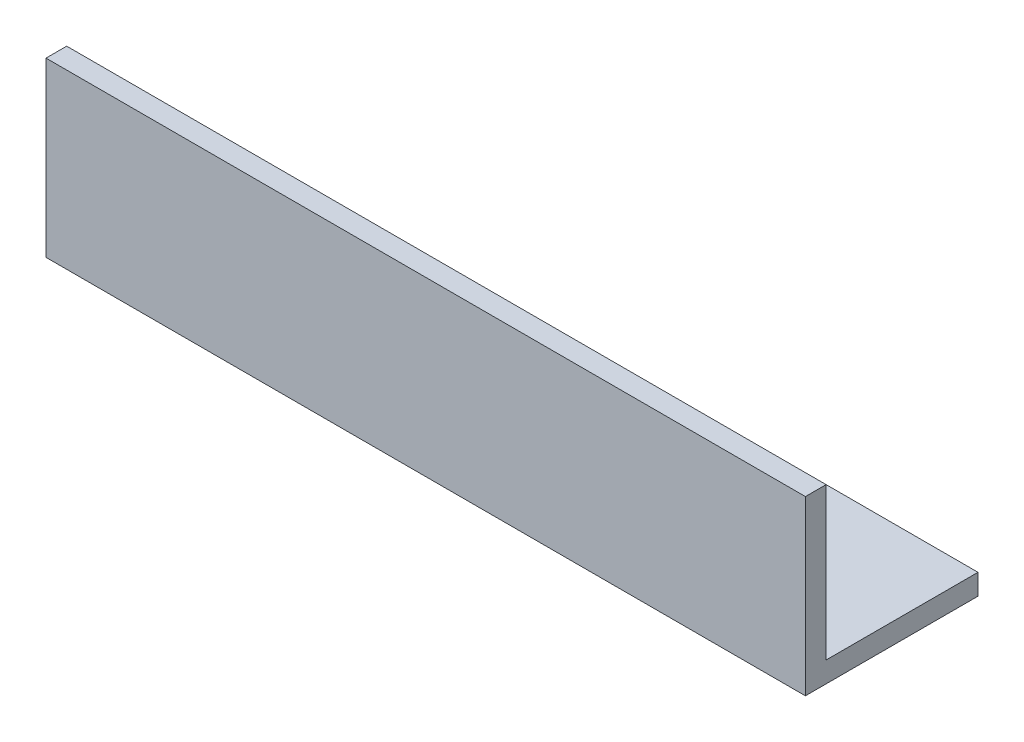
ISO-10303-21;
HEADER;
FILE_DESCRIPTION(('STEP AP214'),'2;1');
FILE_NAME('part.step','',(''),(''),'','','');
FILE_SCHEMA(('AUTOMOTIVE_DESIGN { 1 0 10303 214 1 1 1 1 }'));
ENDSEC;
DATA;
#1=APPLICATION_CONTEXT('core data for automotive mechanical design processes');
#2=APPLICATION_PROTOCOL_DEFINITION('international standard','automotive_design',2000,#1);
#3=PRODUCT_CONTEXT('',#1,'mechanical');
#4=PRODUCT('Part','Part','',(#3));
#5=PRODUCT_RELATED_PRODUCT_CATEGORY('part','',(#4));
#6=PRODUCT_DEFINITION_FORMATION('','',#4);
#7=PRODUCT_DEFINITION_CONTEXT('part definition',#1,'design');
#8=PRODUCT_DEFINITION('design','',#6,#7);
#9=PRODUCT_DEFINITION_SHAPE('','',#8);
#10=(LENGTH_UNIT() NAMED_UNIT(*) SI_UNIT(.MILLI.,.METRE.));
#11=(NAMED_UNIT(*) PLANE_ANGLE_UNIT() SI_UNIT($,.RADIAN.));
#12=(NAMED_UNIT(*) SI_UNIT($,.STERADIAN.) SOLID_ANGLE_UNIT());
#13=UNCERTAINTY_MEASURE_WITH_UNIT(LENGTH_MEASURE(1.E-05),#10,'distance_accuracy_value','');
#14=(GEOMETRIC_REPRESENTATION_CONTEXT(3) GLOBAL_UNCERTAINTY_ASSIGNED_CONTEXT((#13)) GLOBAL_UNIT_ASSIGNED_CONTEXT((#10,
#11,#12)) REPRESENTATION_CONTEXT('',''));
#15=CARTESIAN_POINT('',(0.,0.,0.));
#16=DIRECTION('',(0.,0.,1.));
#17=DIRECTION('',(1.,0.,0.));
#18=AXIS2_PLACEMENT_3D('',#15,#16,#17);
#19=CARTESIAN_POINT('',(110.,25.,-3.));
#20=DIRECTION('',(0.,-1.,0.));
#21=DIRECTION('',(0.,0.,-1.));
#22=AXIS2_PLACEMENT_3D('',#19,#20,#21);
#23=PLANE('',#22);
#24=DIRECTION('',(0.,0.,1.));
#25=VECTOR('',#24,1.);
#26=CARTESIAN_POINT('',(0.,25.,-3.));
#27=LINE('',#26,#25);
#28=CARTESIAN_POINT('',(0.,25.,-3.));
#29=VERTEX_POINT('',#28);
#30=CARTESIAN_POINT('',(0.,25.,0.));
#31=VERTEX_POINT('',#30);
#32=EDGE_CURVE('E118',#29,#31,#27,.T.);
#33=ORIENTED_EDGE('',*,*,#32,.T.);
#34=DIRECTION('',(-1.,0.,0.));
#35=VECTOR('',#34,1.);
#36=CARTESIAN_POINT('',(110.,25.,0.));
#37=LINE('',#36,#35);
#38=CARTESIAN_POINT('',(110.,25.,0.));
#39=VERTEX_POINT('',#38);
#40=EDGE_CURVE('E11',#39,#31,#37,.T.);
#41=ORIENTED_EDGE('',*,*,#40,.F.);
#42=DIRECTION('',(0.,0.,1.));
#43=VECTOR('',#42,1.);
#44=CARTESIAN_POINT('',(110.,25.,-3.));
#45=LINE('',#44,#43);
#46=CARTESIAN_POINT('',(110.,25.,-3.));
#47=VERTEX_POINT('',#46);
#48=EDGE_CURVE('E128',#47,#39,#45,.T.);
#49=ORIENTED_EDGE('',*,*,#48,.F.);
#50=DIRECTION('',(-1.,0.,0.));
#51=VECTOR('',#50,1.);
#52=CARTESIAN_POINT('',(110.,25.,-3.));
#53=LINE('',#52,#51);
#54=EDGE_CURVE('E114',#47,#29,#53,.T.);
#55=ORIENTED_EDGE('',*,*,#54,.T.);
#56=EDGE_LOOP('',(#33,#41,#49,#55));
#57=FACE_BOUND('',#56,.T.);
#58=ADVANCED_FACE('F34',(#57),#23,.F.);
#59=CARTESIAN_POINT('',(110.,25.,0.));
#60=DIRECTION('',(0.,0.,-1.));
#61=DIRECTION('',(0.,1.,0.));
#62=AXIS2_PLACEMENT_3D('',#59,#60,#61);
#63=PLANE('',#62);
#64=DIRECTION('',(0.,-1.,0.));
#65=VECTOR('',#64,1.);
#66=CARTESIAN_POINT('',(0.,25.,0.));
#67=LINE('',#66,#65);
#68=CARTESIAN_POINT('',(0.,0.,0.));
#69=VERTEX_POINT('',#68);
#70=EDGE_CURVE('E121',#31,#69,#67,.T.);
#71=ORIENTED_EDGE('',*,*,#70,.T.);
#72=DIRECTION('',(-1.,0.,0.));
#73=VECTOR('',#72,1.);
#74=CARTESIAN_POINT('',(110.,0.,0.));
#75=LINE('',#74,#73);
#76=CARTESIAN_POINT('',(110.,0.,0.));
#77=VERTEX_POINT('',#76);
#78=EDGE_CURVE('E42',#77,#69,#75,.T.);
#79=ORIENTED_EDGE('',*,*,#78,.F.);
#80=DIRECTION('',(0.,-1.,0.));
#81=VECTOR('',#80,1.);
#82=CARTESIAN_POINT('',(110.,25.,0.));
#83=LINE('',#82,#81);
#84=EDGE_CURVE('E87',#39,#77,#83,.T.);
#85=ORIENTED_EDGE('',*,*,#84,.F.);
#86=ORIENTED_EDGE('',*,*,#40,.T.);
#87=EDGE_LOOP('',(#71,#79,#85,#86));
#88=FACE_BOUND('',#87,.T.);
#89=ADVANCED_FACE('F152',(#88),#63,.F.);
#90=CARTESIAN_POINT('',(110.,0.,0.));
#91=DIRECTION('',(0.,1.,0.));
#92=DIRECTION('',(0.,0.,1.));
#93=AXIS2_PLACEMENT_3D('',#90,#91,#92);
#94=PLANE('',#93);
#95=DIRECTION('',(0.,0.,-1.));
#96=VECTOR('',#95,1.);
#97=CARTESIAN_POINT('',(0.,0.,0.));
#98=LINE('',#97,#96);
#99=CARTESIAN_POINT('',(0.,0.,-25.));
#100=VERTEX_POINT('',#99);
#101=EDGE_CURVE('E123',#69,#100,#98,.T.);
#102=ORIENTED_EDGE('',*,*,#101,.T.);
#103=DIRECTION('',(-1.,0.,0.));
#104=VECTOR('',#103,1.);
#105=CARTESIAN_POINT('',(110.,0.,-25.));
#106=LINE('',#105,#104);
#107=CARTESIAN_POINT('',(110.,0.,-25.));
#108=VERTEX_POINT('',#107);
#109=EDGE_CURVE('E109',#108,#100,#106,.T.);
#110=ORIENTED_EDGE('',*,*,#109,.F.);
#111=DIRECTION('',(0.,0.,-1.));
#112=VECTOR('',#111,1.);
#113=CARTESIAN_POINT('',(110.,0.,0.));
#114=LINE('',#113,#112);
#115=EDGE_CURVE('E100',#77,#108,#114,.T.);
#116=ORIENTED_EDGE('',*,*,#115,.F.);
#117=ORIENTED_EDGE('',*,*,#78,.T.);
#118=EDGE_LOOP('',(#102,#110,#116,#117));
#119=FACE_BOUND('',#118,.T.);
#120=ADVANCED_FACE('F134',(#119),#94,.F.);
#121=CARTESIAN_POINT('',(110.,0.,-25.));
#122=DIRECTION('',(0.,0.,1.));
#123=DIRECTION('',(1.,0.,0.));
#124=AXIS2_PLACEMENT_3D('',#121,#122,#123);
#125=PLANE('',#124);
#126=DIRECTION('',(0.,1.,0.));
#127=VECTOR('',#126,1.);
#128=CARTESIAN_POINT('',(0.,0.,-25.));
#129=LINE('',#128,#127);
#130=CARTESIAN_POINT('',(0.,3.,-25.));
#131=VERTEX_POINT('',#130);
#132=EDGE_CURVE('E108',#100,#131,#129,.T.);
#133=ORIENTED_EDGE('',*,*,#132,.T.);
#134=DIRECTION('',(-1.,0.,0.));
#135=VECTOR('',#134,1.);
#136=CARTESIAN_POINT('',(110.,3.,-25.));
#137=LINE('',#136,#135);
#138=CARTESIAN_POINT('',(110.,3.,-25.));
#139=VERTEX_POINT('',#138);
#140=EDGE_CURVE('E105',#139,#131,#137,.T.);
#141=ORIENTED_EDGE('',*,*,#140,.F.);
#142=DIRECTION('',(0.,1.,0.));
#143=VECTOR('',#142,1.);
#144=CARTESIAN_POINT('',(110.,0.,-25.));
#145=LINE('',#144,#143);
#146=EDGE_CURVE('E94',#108,#139,#145,.T.);
#147=ORIENTED_EDGE('',*,*,#146,.F.);
#148=ORIENTED_EDGE('',*,*,#109,.T.);
#149=EDGE_LOOP('',(#133,#141,#147,#148));
#150=FACE_BOUND('',#149,.T.);
#151=ADVANCED_FACE('F106',(#150),#125,.F.);
#152=CARTESIAN_POINT('',(110.,3.,-25.));
#153=DIRECTION('',(0.,-1.,0.));
#154=DIRECTION('',(0.,0.,-1.));
#155=AXIS2_PLACEMENT_3D('',#152,#153,#154);
#156=PLANE('',#155);
#157=DIRECTION('',(0.,0.,1.));
#158=VECTOR('',#157,1.);
#159=CARTESIAN_POINT('',(0.,3.,-25.));
#160=LINE('',#159,#158);
#161=CARTESIAN_POINT('',(0.,3.,-3.));
#162=VERTEX_POINT('',#161);
#163=EDGE_CURVE('E73',#131,#162,#160,.T.);
#164=ORIENTED_EDGE('',*,*,#163,.T.);
#165=DIRECTION('',(-1.,0.,0.));
#166=VECTOR('',#165,1.);
#167=CARTESIAN_POINT('',(110.,3.,-3.));
#168=LINE('',#167,#166);
#169=CARTESIAN_POINT('',(110.,3.,-3.));
#170=VERTEX_POINT('',#169);
#171=EDGE_CURVE('E110',#170,#162,#168,.T.);
#172=ORIENTED_EDGE('',*,*,#171,.F.);
#173=DIRECTION('',(0.,0.,1.));
#174=VECTOR('',#173,1.);
#175=CARTESIAN_POINT('',(110.,3.,-25.));
#176=LINE('',#175,#174);
#177=EDGE_CURVE('E98',#139,#170,#176,.T.);
#178=ORIENTED_EDGE('',*,*,#177,.F.);
#179=ORIENTED_EDGE('',*,*,#140,.T.);
#180=EDGE_LOOP('',(#164,#172,#178,#179));
#181=FACE_BOUND('',#180,.T.);
#182=ADVANCED_FACE('F112',(#181),#156,.F.);
#183=CARTESIAN_POINT('',(110.,3.,-3.));
#184=DIRECTION('',(0.,0.,1.));
#185=DIRECTION('',(1.,0.,0.));
#186=AXIS2_PLACEMENT_3D('',#183,#184,#185);
#187=PLANE('',#186);
#188=DIRECTION('',(0.,1.,0.));
#189=VECTOR('',#188,1.);
#190=CARTESIAN_POINT('',(0.,3.,-3.));
#191=LINE('',#190,#189);
#192=EDGE_CURVE('E79',#162,#29,#191,.T.);
#193=ORIENTED_EDGE('',*,*,#192,.T.);
#194=ORIENTED_EDGE('',*,*,#54,.F.);
#195=DIRECTION('',(0.,1.,0.));
#196=VECTOR('',#195,1.);
#197=CARTESIAN_POINT('',(110.,3.,-3.));
#198=LINE('',#197,#196);
#199=EDGE_CURVE('E50',#170,#47,#198,.T.);
#200=ORIENTED_EDGE('',*,*,#199,.F.);
#201=ORIENTED_EDGE('',*,*,#171,.T.);
#202=EDGE_LOOP('',(#193,#194,#200,#201));
#203=FACE_BOUND('',#202,.T.);
#204=ADVANCED_FACE('F141',(#203),#187,.F.);
#205=CARTESIAN_POINT('',(110.,0.,0.));
#206=DIRECTION('',(1.,0.,0.));
#207=DIRECTION('',(0.,0.,-1.));
#208=AXIS2_PLACEMENT_3D('',#205,#206,#207);
#209=PLANE('',#208);
#210=ORIENTED_EDGE('',*,*,#48,.T.);
#211=ORIENTED_EDGE('',*,*,#84,.T.);
#212=ORIENTED_EDGE('',*,*,#115,.T.);
#213=ORIENTED_EDGE('',*,*,#146,.T.);
#214=ORIENTED_EDGE('',*,*,#177,.T.);
#215=ORIENTED_EDGE('',*,*,#199,.T.);
#216=EDGE_LOOP('',(#210,#211,#212,#213,#214,#215));
#217=FACE_BOUND('',#216,.T.);
#218=ADVANCED_FACE('F96',(#217),#209,.T.);
#219=CARTESIAN_POINT('',(0.,0.,0.));
#220=DIRECTION('',(1.,0.,0.));
#221=DIRECTION('',(0.,0.,-1.));
#222=AXIS2_PLACEMENT_3D('',#219,#220,#221);
#223=PLANE('',#222);
#224=ORIENTED_EDGE('',*,*,#32,.F.);
#225=ORIENTED_EDGE('',*,*,#192,.F.);
#226=ORIENTED_EDGE('',*,*,#163,.F.);
#227=ORIENTED_EDGE('',*,*,#132,.F.);
#228=ORIENTED_EDGE('',*,*,#101,.F.);
#229=ORIENTED_EDGE('',*,*,#70,.F.);
#230=EDGE_LOOP('',(#224,#225,#226,#227,#228,#229));
#231=FACE_BOUND('',#230,.T.);
#232=ADVANCED_FACE('F137',(#231),#223,.F.);
#233=CLOSED_SHELL('',(#58,#89,#120,#151,#182,#204,#218,#232));
#234=MANIFOLD_SOLID_BREP('B2',#233);
#235=ADVANCED_BREP_SHAPE_REPRESENTATION('',(#18,#234),#14);
#236=SHAPE_DEFINITION_REPRESENTATION(#9,#235);
ENDSEC;
END-ISO-10303-21;
